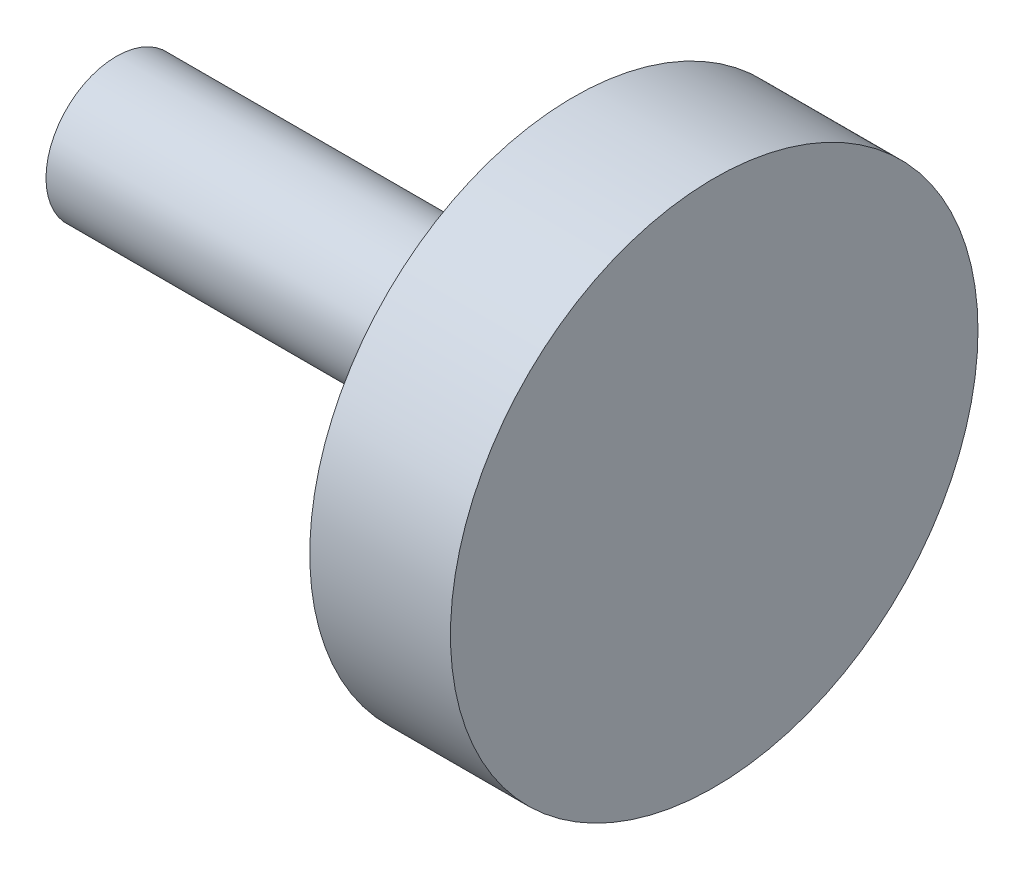
ISO-10303-21;
HEADER;
FILE_DESCRIPTION(('STEP AP214'),'2;1');
FILE_NAME('part.step','',(''),(''),'','','');
FILE_SCHEMA(('AUTOMOTIVE_DESIGN { 1 0 10303 214 1 1 1 1 }'));
ENDSEC;
DATA;
#1=APPLICATION_CONTEXT('core data for automotive mechanical design processes');
#2=APPLICATION_PROTOCOL_DEFINITION('international standard','automotive_design',2000,#1);
#3=PRODUCT_CONTEXT('',#1,'mechanical');
#4=PRODUCT('Part','Part','',(#3));
#5=PRODUCT_RELATED_PRODUCT_CATEGORY('part','',(#4));
#6=PRODUCT_DEFINITION_FORMATION('','',#4);
#7=PRODUCT_DEFINITION_CONTEXT('part definition',#1,'design');
#8=PRODUCT_DEFINITION('design','',#6,#7);
#9=PRODUCT_DEFINITION_SHAPE('','',#8);
#10=(LENGTH_UNIT() NAMED_UNIT(*) SI_UNIT(.MILLI.,.METRE.));
#11=(NAMED_UNIT(*) PLANE_ANGLE_UNIT() SI_UNIT($,.RADIAN.));
#12=(NAMED_UNIT(*) SI_UNIT($,.STERADIAN.) SOLID_ANGLE_UNIT());
#13=UNCERTAINTY_MEASURE_WITH_UNIT(LENGTH_MEASURE(1.E-05),#10,'distance_accuracy_value','');
#14=(GEOMETRIC_REPRESENTATION_CONTEXT(3) GLOBAL_UNCERTAINTY_ASSIGNED_CONTEXT((#13)) GLOBAL_UNIT_ASSIGNED_CONTEXT((#10,
#11,#12)) REPRESENTATION_CONTEXT('',''));
#15=CARTESIAN_POINT('',(0.,0.,0.));
#16=DIRECTION('',(0.,0.,1.));
#17=DIRECTION('',(1.,0.,0.));
#18=AXIS2_PLACEMENT_3D('',#15,#16,#17);
#19=CARTESIAN_POINT('',(0.,0.,0.));
#20=DIRECTION('',(1.,0.,0.));
#21=DIRECTION('',(0.,0.,-1.));
#22=AXIS2_PLACEMENT_3D('',#19,#20,#21);
#23=PLANE('',#22);
#24=CARTESIAN_POINT('',(0.,0.,0.));
#25=DIRECTION('',(1.,0.,0.));
#26=DIRECTION('',(0.,0.,-1.));
#27=AXIS2_PLACEMENT_3D('',#24,#25,#26);
#28=CIRCLE('',#27,7.5);
#29=CARTESIAN_POINT('',(0.,0.,-7.5));
#30=VERTEX_POINT('',#29);
#31=EDGE_CURVE('E42',#30,#30,#28,.T.);
#32=ORIENTED_EDGE('',*,*,#31,.F.);
#33=EDGE_LOOP('',(#32));
#34=FACE_BOUND('',#33,.T.);
#35=CARTESIAN_POINT('',(0.,0.,0.));
#36=DIRECTION('',(1.,0.,0.));
#37=DIRECTION('',(0.,0.,-1.));
#38=AXIS2_PLACEMENT_3D('',#35,#36,#37);
#39=CIRCLE('',#38,2.);
#40=CARTESIAN_POINT('',(0.,0.,-2.));
#41=VERTEX_POINT('',#40);
#42=EDGE_CURVE('E10',#41,#41,#39,.F.);
#43=ORIENTED_EDGE('',*,*,#42,.F.);
#44=EDGE_LOOP('',(#43));
#45=FACE_BOUND('',#44,.T.);
#46=ADVANCED_FACE('F31',(#34,#45),#23,.F.);
#47=CARTESIAN_POINT('',(4.,0.,0.));
#48=DIRECTION('',(-1.,0.,0.));
#49=DIRECTION('',(0.,0.,1.));
#50=AXIS2_PLACEMENT_3D('',#47,#48,#49);
#51=CYLINDRICAL_SURFACE('',#50,7.5);
#52=CARTESIAN_POINT('',(4.,0.,0.));
#53=DIRECTION('',(1.,0.,0.));
#54=DIRECTION('',(0.,0.,-1.));
#55=AXIS2_PLACEMENT_3D('',#52,#53,#54);
#56=CIRCLE('',#55,7.5);
#57=CARTESIAN_POINT('',(4.,0.,-7.5));
#58=VERTEX_POINT('',#57);
#59=EDGE_CURVE('E38',#58,#58,#56,.T.);
#60=ORIENTED_EDGE('',*,*,#59,.F.);
#61=EDGE_LOOP('',(#60));
#62=FACE_BOUND('',#61,.T.);
#63=ORIENTED_EDGE('',*,*,#31,.T.);
#64=EDGE_LOOP('',(#63));
#65=FACE_BOUND('',#64,.T.);
#66=ADVANCED_FACE('F33',(#62,#65),#51,.T.);
#67=CARTESIAN_POINT('',(4.,0.,0.));
#68=DIRECTION('',(1.,0.,0.));
#69=DIRECTION('',(0.,0.,-1.));
#70=AXIS2_PLACEMENT_3D('',#67,#68,#69);
#71=PLANE('',#70);
#72=ORIENTED_EDGE('',*,*,#59,.T.);
#73=EDGE_LOOP('',(#72));
#74=FACE_BOUND('',#73,.T.);
#75=ADVANCED_FACE('F56',(#74),#71,.T.);
#76=CARTESIAN_POINT('',(-13.,0.,0.));
#77=DIRECTION('',(1.,0.,0.));
#78=DIRECTION('',(0.,0.,-1.));
#79=AXIS2_PLACEMENT_3D('',#76,#77,#78);
#80=CYLINDRICAL_SURFACE('',#79,2.);
#81=CARTESIAN_POINT('',(-13.,0.,0.));
#82=DIRECTION('',(-1.,0.,0.));
#83=DIRECTION('',(0.,0.,1.));
#84=AXIS2_PLACEMENT_3D('',#81,#82,#83);
#85=CIRCLE('',#84,2.);
#86=CARTESIAN_POINT('',(-13.,0.,2.));
#87=VERTEX_POINT('',#86);
#88=EDGE_CURVE('E47',#87,#87,#85,.T.);
#89=ORIENTED_EDGE('',*,*,#88,.F.);
#90=EDGE_LOOP('',(#89));
#91=FACE_BOUND('',#90,.T.);
#92=ORIENTED_EDGE('',*,*,#42,.T.);
#93=EDGE_LOOP('',(#92));
#94=FACE_BOUND('',#93,.T.);
#95=ADVANCED_FACE('F54',(#91,#94),#80,.T.);
#96=CARTESIAN_POINT('',(-13.,0.,0.));
#97=DIRECTION('',(-1.,0.,0.));
#98=DIRECTION('',(0.,0.,1.));
#99=AXIS2_PLACEMENT_3D('',#96,#97,#98);
#100=PLANE('',#99);
#101=ORIENTED_EDGE('',*,*,#88,.T.);
#102=EDGE_LOOP('',(#101));
#103=FACE_BOUND('',#102,.T.);
#104=ADVANCED_FACE('F52',(#103),#100,.T.);
#105=CLOSED_SHELL('',(#46,#66,#75,#95,#104));
#106=MANIFOLD_SOLID_BREP('B2',#105);
#107=ADVANCED_BREP_SHAPE_REPRESENTATION('',(#18,#106),#14);
#108=SHAPE_DEFINITION_REPRESENTATION(#9,#107);
ENDSEC;
END-ISO-10303-21;
